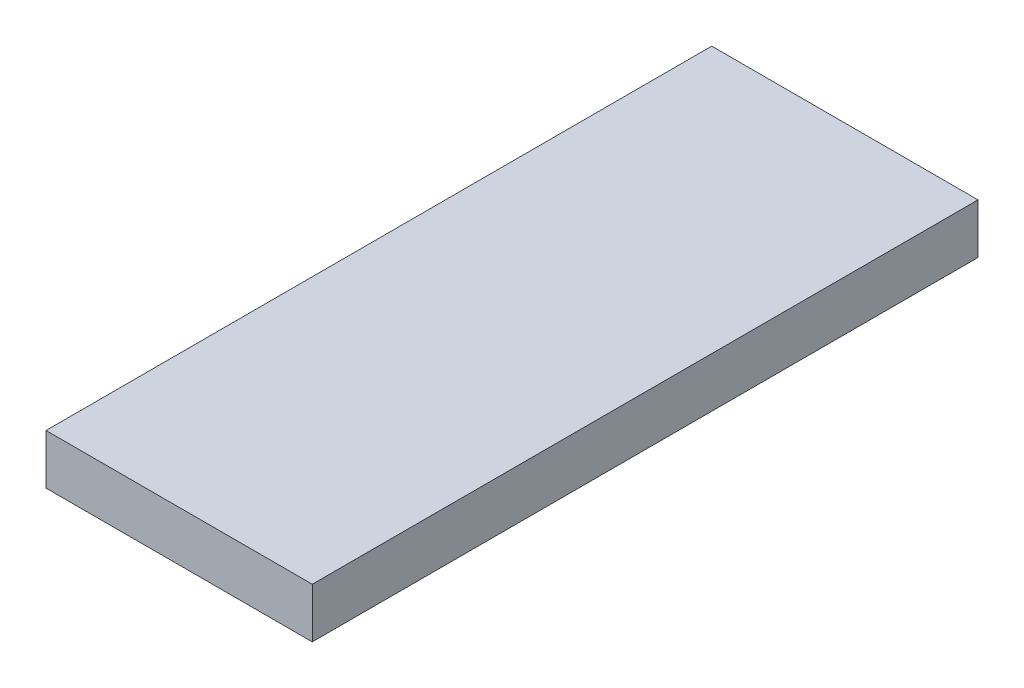
ISO-10303-21;
HEADER;
FILE_DESCRIPTION(('STEP AP214'),'2;1');
FILE_NAME('part.step','',(''),(''),'','','');
FILE_SCHEMA(('AUTOMOTIVE_DESIGN { 1 0 10303 214 1 1 1 1 }'));
ENDSEC;
DATA;
#1=APPLICATION_CONTEXT('core data for automotive mechanical design processes');
#2=APPLICATION_PROTOCOL_DEFINITION('international standard','automotive_design',2000,#1);
#3=PRODUCT_CONTEXT('',#1,'mechanical');
#4=PRODUCT('Part','Part','',(#3));
#5=PRODUCT_RELATED_PRODUCT_CATEGORY('part','',(#4));
#6=PRODUCT_DEFINITION_FORMATION('','',#4);
#7=PRODUCT_DEFINITION_CONTEXT('part definition',#1,'design');
#8=PRODUCT_DEFINITION('design','',#6,#7);
#9=PRODUCT_DEFINITION_SHAPE('','',#8);
#10=(LENGTH_UNIT() NAMED_UNIT(*) SI_UNIT(.MILLI.,.METRE.));
#11=(NAMED_UNIT(*) PLANE_ANGLE_UNIT() SI_UNIT($,.RADIAN.));
#12=(NAMED_UNIT(*) SI_UNIT($,.STERADIAN.) SOLID_ANGLE_UNIT());
#13=UNCERTAINTY_MEASURE_WITH_UNIT(LENGTH_MEASURE(1.E-05),#10,'distance_accuracy_value','');
#14=(GEOMETRIC_REPRESENTATION_CONTEXT(3) GLOBAL_UNCERTAINTY_ASSIGNED_CONTEXT((#13)) GLOBAL_UNIT_ASSIGNED_CONTEXT((#10,
#11,#12)) REPRESENTATION_CONTEXT('',''));
#15=CARTESIAN_POINT('',(0.,0.,0.));
#16=DIRECTION('',(0.,0.,1.));
#17=DIRECTION('',(1.,0.,0.));
#18=AXIS2_PLACEMENT_3D('',#15,#16,#17);
#19=CARTESIAN_POINT('',(8.,3.,-20.));
#20=DIRECTION('',(-1.,0.,0.));
#21=DIRECTION('',(0.,0.,1.));
#22=AXIS2_PLACEMENT_3D('',#19,#20,#21);
#23=PLANE('',#22);
#24=DIRECTION('',(0.,0.,-1.));
#25=VECTOR('',#24,1.);
#26=CARTESIAN_POINT('',(8.,0.,-20.));
#27=LINE('',#26,#25);
#28=CARTESIAN_POINT('',(8.,0.,20.));
#29=VERTEX_POINT('',#28);
#30=CARTESIAN_POINT('',(8.,0.,-20.));
#31=VERTEX_POINT('',#30);
#32=EDGE_CURVE('E98',#29,#31,#27,.T.);
#33=ORIENTED_EDGE('',*,*,#32,.T.);
#34=DIRECTION('',(0.,-1.,0.));
#35=VECTOR('',#34,1.);
#36=CARTESIAN_POINT('',(8.,3.,-20.));
#37=LINE('',#36,#35);
#38=CARTESIAN_POINT('',(8.,3.,-20.));
#39=VERTEX_POINT('',#38);
#40=EDGE_CURVE('E11',#39,#31,#37,.T.);
#41=ORIENTED_EDGE('',*,*,#40,.F.);
#42=DIRECTION('',(0.,0.,-1.));
#43=VECTOR('',#42,1.);
#44=CARTESIAN_POINT('',(8.,3.,-20.));
#45=LINE('',#44,#43);
#46=CARTESIAN_POINT('',(8.,3.,20.));
#47=VERTEX_POINT('',#46);
#48=EDGE_CURVE('E86',#47,#39,#45,.T.);
#49=ORIENTED_EDGE('',*,*,#48,.F.);
#50=DIRECTION('',(0.,-1.,0.));
#51=VECTOR('',#50,1.);
#52=CARTESIAN_POINT('',(8.,3.,20.));
#53=LINE('',#52,#51);
#54=EDGE_CURVE('E94',#47,#29,#53,.T.);
#55=ORIENTED_EDGE('',*,*,#54,.T.);
#56=EDGE_LOOP('',(#33,#41,#49,#55));
#57=FACE_BOUND('',#56,.T.);
#58=ADVANCED_FACE('F35',(#57),#23,.F.);
#59=CARTESIAN_POINT('',(-8.,3.,-20.));
#60=DIRECTION('',(0.,0.,1.));
#61=DIRECTION('',(1.,0.,0.));
#62=AXIS2_PLACEMENT_3D('',#59,#60,#61);
#63=PLANE('',#62);
#64=DIRECTION('',(-1.,0.,0.));
#65=VECTOR('',#64,1.);
#66=CARTESIAN_POINT('',(-8.,0.,-20.));
#67=LINE('',#66,#65);
#68=CARTESIAN_POINT('',(-8.,0.,-20.));
#69=VERTEX_POINT('',#68);
#70=EDGE_CURVE('E90',#31,#69,#67,.T.);
#71=ORIENTED_EDGE('',*,*,#70,.T.);
#72=DIRECTION('',(0.,-1.,0.));
#73=VECTOR('',#72,1.);
#74=CARTESIAN_POINT('',(-8.,3.,-20.));
#75=LINE('',#74,#73);
#76=CARTESIAN_POINT('',(-8.,3.,-20.));
#77=VERTEX_POINT('',#76);
#78=EDGE_CURVE('E43',#77,#69,#75,.T.);
#79=ORIENTED_EDGE('',*,*,#78,.F.);
#80=DIRECTION('',(-1.,0.,0.));
#81=VECTOR('',#80,1.);
#82=CARTESIAN_POINT('',(-8.,3.,-20.));
#83=LINE('',#82,#81);
#84=EDGE_CURVE('E81',#39,#77,#83,.T.);
#85=ORIENTED_EDGE('',*,*,#84,.F.);
#86=ORIENTED_EDGE('',*,*,#40,.T.);
#87=EDGE_LOOP('',(#71,#79,#85,#86));
#88=FACE_BOUND('',#87,.T.);
#89=ADVANCED_FACE('F89',(#88),#63,.F.);
#90=CARTESIAN_POINT('',(-8.,3.,-20.));
#91=DIRECTION('',(1.,0.,0.));
#92=DIRECTION('',(0.,0.,-1.));
#93=AXIS2_PLACEMENT_3D('',#90,#91,#92);
#94=PLANE('',#93);
#95=DIRECTION('',(0.,0.,1.));
#96=VECTOR('',#95,1.);
#97=CARTESIAN_POINT('',(-8.,0.,-20.));
#98=LINE('',#97,#96);
#99=CARTESIAN_POINT('',(-8.,0.,20.));
#100=VERTEX_POINT('',#99);
#101=EDGE_CURVE('E68',#69,#100,#98,.T.);
#102=ORIENTED_EDGE('',*,*,#101,.T.);
#103=DIRECTION('',(0.,-1.,0.));
#104=VECTOR('',#103,1.);
#105=CARTESIAN_POINT('',(-8.,3.,20.));
#106=LINE('',#105,#104);
#107=CARTESIAN_POINT('',(-8.,3.,20.));
#108=VERTEX_POINT('',#107);
#109=EDGE_CURVE('E91',#108,#100,#106,.T.);
#110=ORIENTED_EDGE('',*,*,#109,.F.);
#111=DIRECTION('',(0.,0.,1.));
#112=VECTOR('',#111,1.);
#113=CARTESIAN_POINT('',(-8.,3.,-20.));
#114=LINE('',#113,#112);
#115=EDGE_CURVE('E84',#77,#108,#114,.T.);
#116=ORIENTED_EDGE('',*,*,#115,.F.);
#117=ORIENTED_EDGE('',*,*,#78,.T.);
#118=EDGE_LOOP('',(#102,#110,#116,#117));
#119=FACE_BOUND('',#118,.T.);
#120=ADVANCED_FACE('F92',(#119),#94,.F.);
#121=CARTESIAN_POINT('',(-8.,3.,20.));
#122=DIRECTION('',(0.,0.,-1.));
#123=DIRECTION('',(-1.,0.,0.));
#124=AXIS2_PLACEMENT_3D('',#121,#122,#123);
#125=PLANE('',#124);
#126=DIRECTION('',(1.,0.,0.));
#127=VECTOR('',#126,1.);
#128=CARTESIAN_POINT('',(-8.,0.,20.));
#129=LINE('',#128,#127);
#130=EDGE_CURVE('E74',#100,#29,#129,.T.);
#131=ORIENTED_EDGE('',*,*,#130,.T.);
#132=ORIENTED_EDGE('',*,*,#54,.F.);
#133=DIRECTION('',(1.,0.,0.));
#134=VECTOR('',#133,1.);
#135=CARTESIAN_POINT('',(-8.,3.,20.));
#136=LINE('',#135,#134);
#137=EDGE_CURVE('E51',#108,#47,#136,.T.);
#138=ORIENTED_EDGE('',*,*,#137,.F.);
#139=ORIENTED_EDGE('',*,*,#109,.T.);
#140=EDGE_LOOP('',(#131,#132,#138,#139));
#141=FACE_BOUND('',#140,.T.);
#142=ADVANCED_FACE('F105',(#141),#125,.F.);
#143=CARTESIAN_POINT('',(0.,3.,0.));
#144=DIRECTION('',(0.,1.,0.));
#145=DIRECTION('',(0.,0.,1.));
#146=AXIS2_PLACEMENT_3D('',#143,#144,#145);
#147=PLANE('',#146);
#148=ORIENTED_EDGE('',*,*,#48,.T.);
#149=ORIENTED_EDGE('',*,*,#84,.T.);
#150=ORIENTED_EDGE('',*,*,#115,.T.);
#151=ORIENTED_EDGE('',*,*,#137,.T.);
#152=EDGE_LOOP('',(#148,#149,#150,#151));
#153=FACE_BOUND('',#152,.T.);
#154=ADVANCED_FACE('F82',(#153),#147,.T.);
#155=CARTESIAN_POINT('',(0.,0.,0.));
#156=DIRECTION('',(0.,1.,0.));
#157=DIRECTION('',(0.,0.,1.));
#158=AXIS2_PLACEMENT_3D('',#155,#156,#157);
#159=PLANE('',#158);
#160=ORIENTED_EDGE('',*,*,#32,.F.);
#161=ORIENTED_EDGE('',*,*,#130,.F.);
#162=ORIENTED_EDGE('',*,*,#101,.F.);
#163=ORIENTED_EDGE('',*,*,#70,.F.);
#164=EDGE_LOOP('',(#160,#161,#162,#163));
#165=FACE_BOUND('',#164,.T.);
#166=ADVANCED_FACE('F108',(#165),#159,.F.);
#167=CLOSED_SHELL('',(#58,#89,#120,#142,#154,#166));
#168=MANIFOLD_SOLID_BREP('B2',#167);
#169=ADVANCED_BREP_SHAPE_REPRESENTATION('',(#18,#168),#14);
#170=SHAPE_DEFINITION_REPRESENTATION(#9,#169);
ENDSEC;
END-ISO-10303-21;
